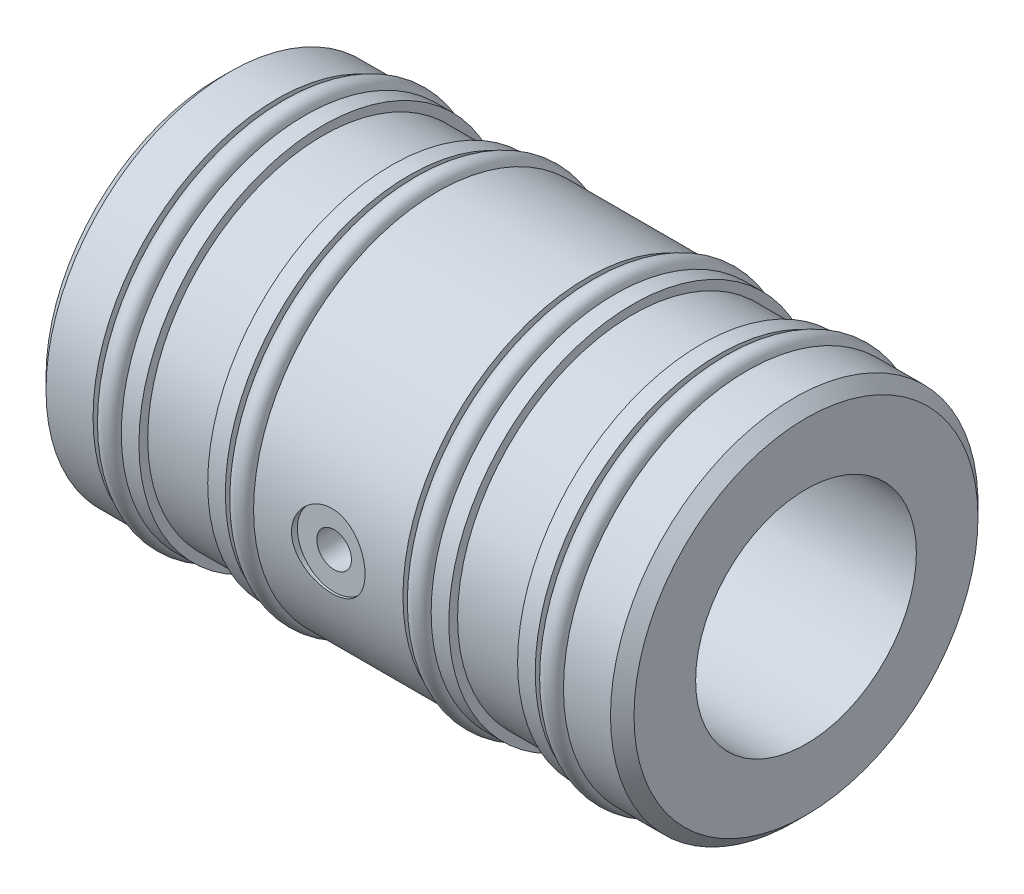
ISO-10303-21;
HEADER;
FILE_DESCRIPTION(('STEP AP214'),'2;1');
FILE_NAME('part.step','',(''),(''),'','','');
FILE_SCHEMA(('AUTOMOTIVE_DESIGN { 1 0 10303 214 1 1 1 1 }'));
ENDSEC;
DATA;
#1=APPLICATION_CONTEXT('core data for automotive mechanical design processes');
#2=APPLICATION_PROTOCOL_DEFINITION('international standard','automotive_design',2000,#1);
#3=PRODUCT_CONTEXT('',#1,'mechanical');
#4=PRODUCT('Part','Part','',(#3));
#5=PRODUCT_RELATED_PRODUCT_CATEGORY('part','',(#4));
#6=PRODUCT_DEFINITION_FORMATION('','',#4);
#7=PRODUCT_DEFINITION_CONTEXT('part definition',#1,'design');
#8=PRODUCT_DEFINITION('design','',#6,#7);
#9=PRODUCT_DEFINITION_SHAPE('','',#8);
#10=(LENGTH_UNIT() NAMED_UNIT(*) SI_UNIT(.MILLI.,.METRE.));
#11=(NAMED_UNIT(*) PLANE_ANGLE_UNIT() SI_UNIT($,.RADIAN.));
#12=(NAMED_UNIT(*) SI_UNIT($,.STERADIAN.) SOLID_ANGLE_UNIT());
#13=UNCERTAINTY_MEASURE_WITH_UNIT(LENGTH_MEASURE(1.E-05),#10,'distance_accuracy_value','');
#14=(GEOMETRIC_REPRESENTATION_CONTEXT(3) GLOBAL_UNCERTAINTY_ASSIGNED_CONTEXT((#13)) GLOBAL_UNIT_ASSIGNED_CONTEXT((#10,
#11,#12)) REPRESENTATION_CONTEXT('',''));
#15=CARTESIAN_POINT('',(0.,0.,0.));
#16=DIRECTION('',(0.,0.,1.));
#17=DIRECTION('',(1.,0.,0.));
#18=AXIS2_PLACEMENT_3D('',#15,#16,#17);
#19=CARTESIAN_POINT('',(0.,0.,0.));
#20=DIRECTION('',(-1.,0.,0.));
#21=DIRECTION('',(0.,0.,1.));
#22=AXIS2_PLACEMENT_3D('',#19,#20,#21);
#23=CYLINDRICAL_SURFACE('',#22,14.605);
#24=CARTESIAN_POINT('',(43.2816,0.,0.));
#25=DIRECTION('',(-1.,0.,0.));
#26=DIRECTION('',(0.,0.,1.));
#27=AXIS2_PLACEMENT_3D('',#24,#25,#26);
#28=CIRCLE('',#27,14.605);
#29=CARTESIAN_POINT('',(43.2816,0.,14.605));
#30=VERTEX_POINT('',#29);
#31=EDGE_CURVE('E307',#30,#30,#28,.T.);
#32=ORIENTED_EDGE('',*,*,#31,.F.);
#33=EDGE_LOOP('',(#32));
#34=FACE_BOUND('',#33,.T.);
#35=CARTESIAN_POINT('',(44.4341764245931,0.,0.));
#36=DIRECTION('',(1.,0.,0.));
#37=DIRECTION('',(0.,0.,-1.));
#38=AXIS2_PLACEMENT_3D('',#35,#36,#37);
#39=CIRCLE('',#38,14.605);
#40=CARTESIAN_POINT('',(44.4341764245931,0.,-14.605));
#41=VERTEX_POINT('',#40);
#42=EDGE_CURVE('E12',#41,#41,#39,.T.);
#43=ORIENTED_EDGE('',*,*,#42,.F.);
#44=EDGE_LOOP('',(#43));
#45=FACE_BOUND('',#44,.T.);
#46=ADVANCED_FACE('F36',(#34,#45),#23,.T.);
#47=CARTESIAN_POINT('',(45.72,0.,0.));
#48=DIRECTION('',(-1.,0.,0.));
#49=DIRECTION('',(0.,0.,1.));
#50=AXIS2_PLACEMENT_3D('',#47,#48,#49);
#51=CIRCLE('',#50,14.605);
#52=CARTESIAN_POINT('',(45.72,0.,14.605));
#53=VERTEX_POINT('',#52);
#54=EDGE_CURVE('E306',#53,#53,#51,.T.);
#55=ORIENTED_EDGE('',*,*,#54,.T.);
#56=EDGE_LOOP('',(#55));
#57=FACE_BOUND('',#56,.T.);
#58=CARTESIAN_POINT('',(44.5674235754069,0.,0.));
#59=DIRECTION('',(-1.,0.,0.));
#60=DIRECTION('',(0.,0.,1.));
#61=AXIS2_PLACEMENT_3D('',#58,#59,#60);
#62=CIRCLE('',#61,14.605);
#63=CARTESIAN_POINT('',(44.5674235754069,0.,14.605));
#64=VERTEX_POINT('',#63);
#65=EDGE_CURVE('E44',#64,#64,#62,.T.);
#66=ORIENTED_EDGE('',*,*,#65,.F.);
#67=EDGE_LOOP('',(#66));
#68=FACE_BOUND('',#67,.T.);
#69=ADVANCED_FACE('F104',(#57,#68),#23,.T.);
#70=CARTESIAN_POINT('',(0.,0.,0.));
#71=DIRECTION('',(-1.,0.,0.));
#72=DIRECTION('',(0.,0.,1.));
#73=AXIS2_PLACEMENT_3D('',#70,#71,#72);
#74=CYLINDRICAL_SURFACE('',#73,14.605);
#75=CARTESIAN_POINT('',(31.8516,0.,0.));
#76=DIRECTION('',(-1.,0.,0.));
#77=DIRECTION('',(0.,0.,1.));
#78=AXIS2_PLACEMENT_3D('',#75,#76,#77);
#79=CIRCLE('',#78,14.605);
#80=CARTESIAN_POINT('',(31.8516,0.,14.605));
#81=VERTEX_POINT('',#80);
#82=EDGE_CURVE('E150',#81,#81,#79,.T.);
#83=ORIENTED_EDGE('',*,*,#82,.F.);
#84=EDGE_LOOP('',(#83));
#85=FACE_BOUND('',#84,.T.);
#86=CARTESIAN_POINT('',(33.0041764245931,0.,0.));
#87=DIRECTION('',(1.,0.,0.));
#88=DIRECTION('',(0.,0.,-1.));
#89=AXIS2_PLACEMENT_3D('',#86,#87,#88);
#90=CIRCLE('',#89,14.605);
#91=CARTESIAN_POINT('',(33.0041764245931,0.,-14.605));
#92=VERTEX_POINT('',#91);
#93=EDGE_CURVE('E292',#92,#92,#90,.T.);
#94=ORIENTED_EDGE('',*,*,#93,.F.);
#95=EDGE_LOOP('',(#94));
#96=FACE_BOUND('',#95,.T.);
#97=ADVANCED_FACE('F134',(#85,#96),#74,.T.);
#98=CARTESIAN_POINT('',(34.29,0.,0.));
#99=DIRECTION('',(-1.,0.,0.));
#100=DIRECTION('',(0.,0.,1.));
#101=AXIS2_PLACEMENT_3D('',#98,#99,#100);
#102=CIRCLE('',#101,14.605);
#103=CARTESIAN_POINT('',(34.29,0.,14.605));
#104=VERTEX_POINT('',#103);
#105=EDGE_CURVE('E151',#104,#104,#102,.T.);
#106=ORIENTED_EDGE('',*,*,#105,.T.);
#107=EDGE_LOOP('',(#106));
#108=FACE_BOUND('',#107,.T.);
#109=CARTESIAN_POINT('',(33.1374235754069,0.,0.));
#110=DIRECTION('',(-1.,0.,0.));
#111=DIRECTION('',(0.,0.,1.));
#112=AXIS2_PLACEMENT_3D('',#109,#110,#111);
#113=CIRCLE('',#112,14.605);
#114=CARTESIAN_POINT('',(33.1374235754069,0.,14.605));
#115=VERTEX_POINT('',#114);
#116=EDGE_CURVE('E285',#115,#115,#113,.T.);
#117=ORIENTED_EDGE('',*,*,#116,.F.);
#118=EDGE_LOOP('',(#117));
#119=FACE_BOUND('',#118,.T.);
#120=ADVANCED_FACE('F136',(#108,#119),#74,.T.);
#121=CARTESIAN_POINT('',(0.,0.,0.));
#122=DIRECTION('',(-1.,0.,0.));
#123=DIRECTION('',(0.,0.,1.));
#124=AXIS2_PLACEMENT_3D('',#121,#122,#123);
#125=CYLINDRICAL_SURFACE('',#124,14.605);
#126=CARTESIAN_POINT('',(16.51,0.,0.));
#127=DIRECTION('',(-1.,0.,0.));
#128=DIRECTION('',(0.,0.,1.));
#129=AXIS2_PLACEMENT_3D('',#126,#127,#128);
#130=CIRCLE('',#129,14.605);
#131=CARTESIAN_POINT('',(16.51,0.,14.605));
#132=VERTEX_POINT('',#131);
#133=EDGE_CURVE('E165',#132,#132,#130,.T.);
#134=ORIENTED_EDGE('',*,*,#133,.F.);
#135=EDGE_LOOP('',(#134));
#136=FACE_BOUND('',#135,.T.);
#137=CARTESIAN_POINT('',(17.6625764245931,0.,0.));
#138=DIRECTION('',(1.,0.,0.));
#139=DIRECTION('',(0.,0.,-1.));
#140=AXIS2_PLACEMENT_3D('',#137,#138,#139);
#141=CIRCLE('',#140,14.605);
#142=CARTESIAN_POINT('',(17.6625764245931,0.,-14.605));
#143=VERTEX_POINT('',#142);
#144=EDGE_CURVE('E282',#143,#143,#141,.T.);
#145=ORIENTED_EDGE('',*,*,#144,.F.);
#146=EDGE_LOOP('',(#145));
#147=FACE_BOUND('',#146,.T.);
#148=ADVANCED_FACE('F264',(#136,#147),#125,.T.);
#149=CARTESIAN_POINT('',(18.9484,0.,0.));
#150=DIRECTION('',(-1.,0.,0.));
#151=DIRECTION('',(0.,0.,1.));
#152=AXIS2_PLACEMENT_3D('',#149,#150,#151);
#153=CIRCLE('',#152,14.605);
#154=CARTESIAN_POINT('',(18.9484,0.,14.605));
#155=VERTEX_POINT('',#154);
#156=EDGE_CURVE('E162',#155,#155,#153,.T.);
#157=ORIENTED_EDGE('',*,*,#156,.T.);
#158=EDGE_LOOP('',(#157));
#159=FACE_BOUND('',#158,.T.);
#160=CARTESIAN_POINT('',(17.7958235754069,0.,0.));
#161=DIRECTION('',(-1.,0.,0.));
#162=DIRECTION('',(0.,0.,1.));
#163=AXIS2_PLACEMENT_3D('',#160,#161,#162);
#164=CIRCLE('',#163,14.605);
#165=CARTESIAN_POINT('',(17.7958235754069,0.,14.605));
#166=VERTEX_POINT('',#165);
#167=EDGE_CURVE('E280',#166,#166,#164,.T.);
#168=ORIENTED_EDGE('',*,*,#167,.F.);
#169=EDGE_LOOP('',(#168));
#170=FACE_BOUND('',#169,.T.);
#171=ADVANCED_FACE('F235',(#159,#170),#125,.T.);
#172=CARTESIAN_POINT('',(0.,0.,0.));
#173=DIRECTION('',(-1.,0.,0.));
#174=DIRECTION('',(0.,0.,1.));
#175=AXIS2_PLACEMENT_3D('',#172,#173,#174);
#176=CYLINDRICAL_SURFACE('',#175,14.605);
#177=CARTESIAN_POINT('',(5.08,0.,0.));
#178=DIRECTION('',(-1.,0.,0.));
#179=DIRECTION('',(0.,0.,1.));
#180=AXIS2_PLACEMENT_3D('',#177,#178,#179);
#181=CIRCLE('',#180,14.605);
#182=CARTESIAN_POINT('',(5.08,0.,14.605));
#183=VERTEX_POINT('',#182);
#184=EDGE_CURVE('E189',#183,#183,#181,.T.);
#185=ORIENTED_EDGE('',*,*,#184,.F.);
#186=EDGE_LOOP('',(#185));
#187=FACE_BOUND('',#186,.T.);
#188=CARTESIAN_POINT('',(6.23257642459312,0.,0.));
#189=DIRECTION('',(1.,0.,0.));
#190=DIRECTION('',(0.,0.,-1.));
#191=AXIS2_PLACEMENT_3D('',#188,#189,#190);
#192=CIRCLE('',#191,14.605);
#193=CARTESIAN_POINT('',(6.23257642459312,0.,-14.605));
#194=VERTEX_POINT('',#193);
#195=EDGE_CURVE('E61',#194,#194,#192,.T.);
#196=ORIENTED_EDGE('',*,*,#195,.F.);
#197=EDGE_LOOP('',(#196));
#198=FACE_BOUND('',#197,.T.);
#199=ADVANCED_FACE('F232',(#187,#198),#176,.T.);
#200=CARTESIAN_POINT('',(7.5184,0.,0.));
#201=DIRECTION('',(-1.,0.,0.));
#202=DIRECTION('',(0.,0.,1.));
#203=AXIS2_PLACEMENT_3D('',#200,#201,#202);
#204=CIRCLE('',#203,14.605);
#205=CARTESIAN_POINT('',(7.5184,0.,14.605));
#206=VERTEX_POINT('',#205);
#207=EDGE_CURVE('E186',#206,#206,#204,.T.);
#208=ORIENTED_EDGE('',*,*,#207,.T.);
#209=EDGE_LOOP('',(#208));
#210=FACE_BOUND('',#209,.T.);
#211=CARTESIAN_POINT('',(6.36582357540688,0.,0.));
#212=DIRECTION('',(-1.,0.,0.));
#213=DIRECTION('',(0.,0.,1.));
#214=AXIS2_PLACEMENT_3D('',#211,#212,#213);
#215=CIRCLE('',#214,14.605);
#216=CARTESIAN_POINT('',(6.36582357540688,0.,14.605));
#217=VERTEX_POINT('',#216);
#218=EDGE_CURVE('E59',#217,#217,#215,.T.);
#219=ORIENTED_EDGE('',*,*,#218,.F.);
#220=EDGE_LOOP('',(#219));
#221=FACE_BOUND('',#220,.T.);
#222=ADVANCED_FACE('F222',(#210,#221),#176,.T.);
#223=CARTESIAN_POINT('',(0.,9.53516,0.));
#224=DIRECTION('',(1.,0.,0.));
#225=DIRECTION('',(0.,0.,-1.));
#226=AXIS2_PLACEMENT_3D('',#223,#224,#225);
#227=PLANE('',#226);
#228=CARTESIAN_POINT('',(0.,0.,0.));
#229=DIRECTION('',(1.,0.,0.));
#230=DIRECTION('',(0.,0.,-1.));
#231=AXIS2_PLACEMENT_3D('',#228,#229,#230);
#232=CIRCLE('',#231,14.859);
#233=CARTESIAN_POINT('',(0.,0.,-14.859));
#234=VERTEX_POINT('',#233);
#235=EDGE_CURVE('E195',#234,#234,#232,.F.);
#236=ORIENTED_EDGE('',*,*,#235,.T.);
#237=EDGE_LOOP('',(#236));
#238=FACE_BOUND('',#237,.T.);
#239=CARTESIAN_POINT('',(0.,0.,0.));
#240=DIRECTION('',(-1.,0.,0.));
#241=DIRECTION('',(0.,0.,1.));
#242=AXIS2_PLACEMENT_3D('',#239,#240,#241);
#243=CIRCLE('',#242,9.53516);
#244=CARTESIAN_POINT('',(0.,0.,9.53516));
#245=VERTEX_POINT('',#244);
#246=EDGE_CURVE('E379',#245,#245,#243,.T.);
#247=ORIENTED_EDGE('',*,*,#246,.F.);
#248=EDGE_LOOP('',(#247));
#249=FACE_BOUND('',#248,.T.);
#250=ADVANCED_FACE('F218',(#238,#249),#227,.F.);
#251=CARTESIAN_POINT('',(0.,0.,0.));
#252=DIRECTION('',(-1.,0.,0.));
#253=DIRECTION('',(0.,0.,1.));
#254=AXIS2_PLACEMENT_3D('',#251,#252,#253);
#255=CYLINDRICAL_SURFACE('',#254,15.875);
#256=CARTESIAN_POINT('',(1.01600000000001,0.,0.));
#257=DIRECTION('',(1.,0.,0.));
#258=DIRECTION('',(0.,0.,-1.));
#259=AXIS2_PLACEMENT_3D('',#256,#257,#258);
#260=CIRCLE('',#259,15.875);
#261=CARTESIAN_POINT('',(1.01600000000001,0.,-15.875));
#262=VERTEX_POINT('',#261);
#263=EDGE_CURVE('E198',#262,#262,#260,.T.);
#264=ORIENTED_EDGE('',*,*,#263,.T.);
#265=EDGE_LOOP('',(#264));
#266=FACE_BOUND('',#265,.T.);
#267=CARTESIAN_POINT('',(5.08,0.,0.));
#268=DIRECTION('',(-1.,0.,0.));
#269=DIRECTION('',(0.,0.,1.));
#270=AXIS2_PLACEMENT_3D('',#267,#268,#269);
#271=CIRCLE('',#270,15.875);
#272=CARTESIAN_POINT('',(5.08,0.,15.875));
#273=VERTEX_POINT('',#272);
#274=EDGE_CURVE('E192',#273,#273,#271,.T.);
#275=ORIENTED_EDGE('',*,*,#274,.T.);
#276=EDGE_LOOP('',(#275));
#277=FACE_BOUND('',#276,.T.);
#278=ADVANCED_FACE('F221',(#266,#277),#255,.T.);
#279=CARTESIAN_POINT('',(5.08,15.875,0.));
#280=DIRECTION('',(-1.,0.,0.));
#281=DIRECTION('',(0.,0.,1.));
#282=AXIS2_PLACEMENT_3D('',#279,#280,#281);
#283=PLANE('',#282);
#284=ORIENTED_EDGE('',*,*,#274,.F.);
#285=EDGE_LOOP('',(#284));
#286=FACE_BOUND('',#285,.T.);
#287=ORIENTED_EDGE('',*,*,#184,.T.);
#288=EDGE_LOOP('',(#287));
#289=FACE_BOUND('',#288,.T.);
#290=ADVANCED_FACE('F226',(#286,#289),#283,.F.);
#291=CARTESIAN_POINT('',(7.5184,14.605,0.));
#292=DIRECTION('',(1.,0.,0.));
#293=DIRECTION('',(0.,0.,-1.));
#294=AXIS2_PLACEMENT_3D('',#291,#292,#293);
#295=PLANE('',#294);
#296=ORIENTED_EDGE('',*,*,#207,.F.);
#297=EDGE_LOOP('',(#296));
#298=FACE_BOUND('',#297,.T.);
#299=CARTESIAN_POINT('',(7.5184,0.,0.));
#300=DIRECTION('',(-1.,0.,0.));
#301=DIRECTION('',(0.,0.,1.));
#302=AXIS2_PLACEMENT_3D('',#299,#300,#301);
#303=CIRCLE('',#302,15.875);
#304=CARTESIAN_POINT('',(7.5184,0.,15.875));
#305=VERTEX_POINT('',#304);
#306=EDGE_CURVE('E183',#305,#305,#303,.T.);
#307=ORIENTED_EDGE('',*,*,#306,.T.);
#308=EDGE_LOOP('',(#307));
#309=FACE_BOUND('',#308,.T.);
#310=ADVANCED_FACE('F230',(#298,#309),#295,.F.);
#311=CARTESIAN_POINT('',(0.,0.,0.));
#312=DIRECTION('',(-1.,0.,0.));
#313=DIRECTION('',(0.,0.,1.));
#314=AXIS2_PLACEMENT_3D('',#311,#312,#313);
#315=CYLINDRICAL_SURFACE('',#314,15.875);
#316=ORIENTED_EDGE('',*,*,#306,.F.);
#317=EDGE_LOOP('',(#316));
#318=FACE_BOUND('',#317,.T.);
#319=CARTESIAN_POINT('',(9.0424,0.,0.));
#320=DIRECTION('',(-1.,0.,0.));
#321=DIRECTION('',(0.,0.,1.));
#322=AXIS2_PLACEMENT_3D('',#319,#320,#321);
#323=CIRCLE('',#322,15.875);
#324=CARTESIAN_POINT('',(9.0424,0.,15.875));
#325=VERTEX_POINT('',#324);
#326=EDGE_CURVE('E180',#325,#325,#323,.T.);
#327=ORIENTED_EDGE('',*,*,#326,.T.);
#328=EDGE_LOOP('',(#327));
#329=FACE_BOUND('',#328,.T.);
#330=ADVANCED_FACE('F239',(#318,#329),#315,.T.);
#331=CARTESIAN_POINT('',(9.0424,15.875,0.));
#332=DIRECTION('',(-1.,0.,0.));
#333=DIRECTION('',(0.,0.,1.));
#334=AXIS2_PLACEMENT_3D('',#331,#332,#333);
#335=PLANE('',#334);
#336=ORIENTED_EDGE('',*,*,#326,.F.);
#337=EDGE_LOOP('',(#336));
#338=FACE_BOUND('',#337,.T.);
#339=CARTESIAN_POINT('',(9.0424,0.,0.));
#340=DIRECTION('',(-1.,0.,0.));
#341=DIRECTION('',(0.,0.,1.));
#342=AXIS2_PLACEMENT_3D('',#339,#340,#341);
#343=CIRCLE('',#342,15.113);
#344=CARTESIAN_POINT('',(9.0424,0.,15.113));
#345=VERTEX_POINT('',#344);
#346=EDGE_CURVE('E177',#345,#345,#343,.T.);
#347=ORIENTED_EDGE('',*,*,#346,.T.);
#348=EDGE_LOOP('',(#347));
#349=FACE_BOUND('',#348,.T.);
#350=ADVANCED_FACE('F243',(#338,#349),#335,.F.);
#351=CARTESIAN_POINT('',(0.,0.,0.));
#352=DIRECTION('',(-1.,0.,0.));
#353=DIRECTION('',(0.,0.,1.));
#354=AXIS2_PLACEMENT_3D('',#351,#352,#353);
#355=CYLINDRICAL_SURFACE('',#354,15.113);
#356=ORIENTED_EDGE('',*,*,#346,.F.);
#357=EDGE_LOOP('',(#356));
#358=FACE_BOUND('',#357,.T.);
#359=CARTESIAN_POINT('',(14.986,0.,0.));
#360=DIRECTION('',(-1.,0.,0.));
#361=DIRECTION('',(0.,0.,1.));
#362=AXIS2_PLACEMENT_3D('',#359,#360,#361);
#363=CIRCLE('',#362,15.113);
#364=CARTESIAN_POINT('',(14.986,0.,15.113));
#365=VERTEX_POINT('',#364);
#366=EDGE_CURVE('E174',#365,#365,#363,.T.);
#367=ORIENTED_EDGE('',*,*,#366,.T.);
#368=EDGE_LOOP('',(#367));
#369=FACE_BOUND('',#368,.T.);
#370=ADVANCED_FACE('F247',(#358,#369),#355,.T.);
#371=CARTESIAN_POINT('',(14.986,15.113,0.));
#372=DIRECTION('',(1.,0.,0.));
#373=DIRECTION('',(0.,0.,-1.));
#374=AXIS2_PLACEMENT_3D('',#371,#372,#373);
#375=PLANE('',#374);
#376=ORIENTED_EDGE('',*,*,#366,.F.);
#377=EDGE_LOOP('',(#376));
#378=FACE_BOUND('',#377,.T.);
#379=CARTESIAN_POINT('',(14.986,0.,0.));
#380=DIRECTION('',(-1.,0.,0.));
#381=DIRECTION('',(0.,0.,1.));
#382=AXIS2_PLACEMENT_3D('',#379,#380,#381);
#383=CIRCLE('',#382,15.875);
#384=CARTESIAN_POINT('',(14.986,0.,15.875));
#385=VERTEX_POINT('',#384);
#386=EDGE_CURVE('E171',#385,#385,#383,.T.);
#387=ORIENTED_EDGE('',*,*,#386,.T.);
#388=EDGE_LOOP('',(#387));
#389=FACE_BOUND('',#388,.T.);
#390=ADVANCED_FACE('F251',(#378,#389),#375,.F.);
#391=CARTESIAN_POINT('',(0.,0.,0.));
#392=DIRECTION('',(-1.,0.,0.));
#393=DIRECTION('',(0.,0.,1.));
#394=AXIS2_PLACEMENT_3D('',#391,#392,#393);
#395=CYLINDRICAL_SURFACE('',#394,15.875);
#396=ORIENTED_EDGE('',*,*,#386,.F.);
#397=EDGE_LOOP('',(#396));
#398=FACE_BOUND('',#397,.T.);
#399=CARTESIAN_POINT('',(16.51,0.,0.));
#400=DIRECTION('',(-1.,0.,0.));
#401=DIRECTION('',(0.,0.,1.));
#402=AXIS2_PLACEMENT_3D('',#399,#400,#401);
#403=CIRCLE('',#402,15.875);
#404=CARTESIAN_POINT('',(16.51,0.,15.875));
#405=VERTEX_POINT('',#404);
#406=EDGE_CURVE('E168',#405,#405,#403,.T.);
#407=ORIENTED_EDGE('',*,*,#406,.T.);
#408=EDGE_LOOP('',(#407));
#409=FACE_BOUND('',#408,.T.);
#410=ADVANCED_FACE('F255',(#398,#409),#395,.T.);
#411=CARTESIAN_POINT('',(16.51,15.875,0.));
#412=DIRECTION('',(-1.,0.,0.));
#413=DIRECTION('',(0.,0.,1.));
#414=AXIS2_PLACEMENT_3D('',#411,#412,#413);
#415=PLANE('',#414);
#416=ORIENTED_EDGE('',*,*,#406,.F.);
#417=EDGE_LOOP('',(#416));
#418=FACE_BOUND('',#417,.T.);
#419=ORIENTED_EDGE('',*,*,#133,.T.);
#420=EDGE_LOOP('',(#419));
#421=FACE_BOUND('',#420,.T.);
#422=ADVANCED_FACE('F259',(#418,#421),#415,.F.);
#423=CARTESIAN_POINT('',(18.9484,14.605,0.));
#424=DIRECTION('',(1.,0.,0.));
#425=DIRECTION('',(0.,0.,-1.));
#426=AXIS2_PLACEMENT_3D('',#423,#424,#425);
#427=PLANE('',#426);
#428=ORIENTED_EDGE('',*,*,#156,.F.);
#429=EDGE_LOOP('',(#428));
#430=FACE_BOUND('',#429,.T.);
#431=CARTESIAN_POINT('',(18.9484,0.,0.));
#432=DIRECTION('',(-1.,0.,0.));
#433=DIRECTION('',(0.,0.,1.));
#434=AXIS2_PLACEMENT_3D('',#431,#432,#433);
#435=CIRCLE('',#434,15.875);
#436=CARTESIAN_POINT('',(18.9484,0.,15.875));
#437=VERTEX_POINT('',#436);
#438=EDGE_CURVE('E153',#437,#437,#435,.T.);
#439=ORIENTED_EDGE('',*,*,#438,.T.);
#440=EDGE_LOOP('',(#439));
#441=FACE_BOUND('',#440,.T.);
#442=ADVANCED_FACE('F143',(#430,#441),#427,.F.);
#443=CARTESIAN_POINT('',(0.,0.,0.));
#444=DIRECTION('',(-1.,0.,0.));
#445=DIRECTION('',(0.,0.,1.));
#446=AXIS2_PLACEMENT_3D('',#443,#444,#445);
#447=CYLINDRICAL_SURFACE('',#446,15.875);
#448=CARTESIAN_POINT('',(28.575,0.,15.875));
#449=CARTESIAN_POINT('',(28.5749935087178,-0.17645667906661,15.8749967481927));
#450=CARTESIAN_POINT('',(28.5602399235777,-0.352995421139834,15.8720277294088));
#451=CARTESIAN_POINT('',(28.5016622621341,-0.701082886912636,15.8604701085376));
#452=CARTESIAN_POINT('',(28.4578150908552,-0.872627533193804,15.8518770420609));
#453=CARTESIAN_POINT('',(28.342458956254,-1.20564371921102,15.8300308645856));
#454=CARTESIAN_POINT('',(28.2709764880181,-1.3671247356877,15.8167822181858));
#455=CARTESIAN_POINT('',(28.1024576141516,-1.67579036464392,15.7870651376212));
#456=CARTESIAN_POINT('',(28.0054227304471,-1.8229758278657,15.7705968952337));
#457=CARTESIAN_POINT('',(27.7871602806247,-2.1008767904747,15.7360037492265));
#458=CARTESIAN_POINT('',(27.6656534716329,-2.23137079492832,15.717861169763));
#459=CARTESIAN_POINT('',(27.4024965779563,-2.47026670223049,15.6820927293697));
#460=CARTESIAN_POINT('',(27.260844921511,-2.5786668796461,15.6644669088885));
#461=CARTESIAN_POINT('',(26.9598260871873,-2.77124081687869,15.6315550275505));
#462=CARTESIAN_POINT('',(26.8003094809466,-2.85518523089913,15.616291708837));
#463=CARTESIAN_POINT('',(26.469080224662,-2.99499549139248,15.5900840108548));
#464=CARTESIAN_POINT('',(26.2973687813754,-3.05086411173823,15.5791392049423));
#465=CARTESIAN_POINT('',(25.9490071445924,-3.13221782713433,15.5629865667575));
#466=CARTESIAN_POINT('',(25.7724511723484,-3.15809153101912,15.5577054259032));
#467=CARTESIAN_POINT('',(25.4174313171682,-3.17992800553043,15.5532574081749));
#468=CARTESIAN_POINT('',(25.2389676311835,-3.17589383461536,15.5540899061039));
#469=CARTESIAN_POINT('',(24.8880414480333,-3.13834326959827,15.5617084989549));
#470=CARTESIAN_POINT('',(24.7155290371333,-3.1052723652744,15.5684046282657));
#471=CARTESIAN_POINT('',(24.378551456595,-3.01129028367818,15.58685434058));
#472=CARTESIAN_POINT('',(24.2140866716821,-2.95037777684466,15.5986081651095));
#473=CARTESIAN_POINT('',(23.8965890440911,-2.80201618816723,15.625940887388));
#474=CARTESIAN_POINT('',(23.7436409823679,-2.71439053016196,15.6415451015851));
#475=CARTESIAN_POINT('',(23.4544525513363,-2.51521459926825,15.6748041460447));
#476=CARTESIAN_POINT('',(23.3182141049976,-2.40366157683293,15.6924592118681));
#477=CARTESIAN_POINT('',(23.0637416471992,-2.15741229222985,15.7282204244164));
#478=CARTESIAN_POINT('',(22.9458755970473,-2.02233581184951,15.7463289724462));
#479=CARTESIAN_POINT('',(22.7344165379936,-1.73413745139688,15.7806659466825));
#480=CARTESIAN_POINT('',(22.6408238403929,-1.58101533992956,15.7968943487749));
#481=CARTESIAN_POINT('',(22.4805001582075,-1.26066355334057,15.8256824126082));
#482=CARTESIAN_POINT('',(22.4138112376786,-1.09341227718333,15.8382363209326));
#483=CARTESIAN_POINT('',(22.3095804949275,-0.74977300022451,15.8582172353645));
#484=CARTESIAN_POINT('',(22.2720351419162,-0.573386108980027,15.8656448625169));
#485=CARTESIAN_POINT('',(22.2276782592032,-0.219644612866203,15.8744498317731));
#486=CARTESIAN_POINT('',(22.2203631679596,-0.0423555424337052,15.8759262952159));
#487=CARTESIAN_POINT('',(22.2353183021414,0.310911666061866,15.8729378987808));
#488=CARTESIAN_POINT('',(22.2575868644445,0.486889877259043,15.8684733728909));
#489=CARTESIAN_POINT('',(22.3306588360021,0.830915470330267,15.8541666662546));
#490=CARTESIAN_POINT('',(22.3812038674808,0.999019935979192,15.8443732008336));
#491=CARTESIAN_POINT('',(22.5091116449322,1.32436751731144,15.8205027779378));
#492=CARTESIAN_POINT('',(22.5864764000989,1.48160981819919,15.8064254995517));
#493=CARTESIAN_POINT('',(22.7669169078179,1.78289322645374,15.7753021911821));
#494=CARTESIAN_POINT('',(22.8702958297986,1.9267491524382,15.7582219263764));
#495=CARTESIAN_POINT('',(23.0994241820831,2.19525221070348,15.7230678308488));
#496=CARTESIAN_POINT('',(23.2251760108196,2.31989728085517,15.7049938937463));
#497=CARTESIAN_POINT('',(23.4977728922543,2.54838387570801,15.6695553879336));
#498=CARTESIAN_POINT('',(23.6449099879027,2.65187970527448,15.6522058124074));
#499=CARTESIAN_POINT('',(23.9547760723075,2.83268870866258,15.6204980895292));
#500=CARTESIAN_POINT('',(24.117504436896,2.91000293005522,15.6061398224986));
#501=CARTESIAN_POINT('',(24.4531141815248,3.03578209702272,15.5821615135542));
#502=CARTESIAN_POINT('',(24.6259376708428,3.08439661183659,15.5725169521919));
#503=CARTESIAN_POINT('',(24.9775137148336,3.15184996891635,15.5590061181468));
#504=CARTESIAN_POINT('',(25.1562654932147,3.17069269411473,15.5551390919428));
#505=CARTESIAN_POINT('',(25.5111531449282,3.17792389200421,15.5536630007963));
#506=CARTESIAN_POINT('',(25.6872776478433,3.1668586271251,15.5559416842603));
#507=CARTESIAN_POINT('',(26.0351004884485,3.11579356551769,15.5662494581365));
#508=CARTESIAN_POINT('',(26.206798861681,3.07579400121052,15.5742785023576));
#509=CARTESIAN_POINT('',(26.5405479831887,2.96823945498418,15.5951321389583));
#510=CARTESIAN_POINT('',(26.7026210945952,2.90075145882757,15.6079450673479));
#511=CARTESIAN_POINT('',(27.0132293133319,2.74019849661009,15.6369294504299));
#512=CARTESIAN_POINT('',(27.1617632840773,2.64713138586025,15.6531011867149));
#513=CARTESIAN_POINT('',(27.4437969415772,2.43619627944687,15.6873244966124));
#514=CARTESIAN_POINT('',(27.5769983297246,2.3179337919717,15.705403339883));
#515=CARTESIAN_POINT('',(27.8218462025551,2.06077937161672,15.7412080994346));
#516=CARTESIAN_POINT('',(27.9334877267573,1.92188270421184,15.7589339336561));
#517=CARTESIAN_POINT('',(28.13314999453,1.62565597235519,15.7922541783181));
#518=CARTESIAN_POINT('',(28.2209113104141,1.46814820806473,15.8078243412111));
#519=CARTESIAN_POINT('',(28.3685809392442,1.14035319598683,15.8348402214487));
#520=CARTESIAN_POINT('',(28.4285143567657,0.970077628240428,15.8462896541511));
#521=CARTESIAN_POINT('',(28.507219935042,0.666183227333001,15.861549829903));
#522=CARTESIAN_POINT('',(28.5325921400221,0.534294283243766,15.8665641252808));
#523=CARTESIAN_POINT('',(28.5664843717378,0.268285992541962,15.8732903939416));
#524=CARTESIAN_POINT('',(28.5750049355685,0.134166717151865,15.8750024724727));
#525=CARTESIAN_POINT('',(28.575,0.,15.875));
#526=B_SPLINE_CURVE_WITH_KNOTS('',3,(#448,#449,#450,#451,#452,#453,#454,#455,#456,#457,#458,
#459,#460,#461,#462,#463,#464,#465,#466,#467,#468,#469,#470,#471,#472,#473,#474,#475,#476,#477,
#478,#479,#480,#481,#482,#483,#484,#485,#486,#487,#488,#489,#490,#491,#492,#493,#494,#495,#496,
#497,#498,#499,#500,#501,#502,#503,#504,#505,#506,#507,#508,#509,#510,#511,#512,#513,#514,#515,
#516,#517,#518,#519,#520,#521,#522,#523,#524,#525),.UNSPECIFIED.,.T.,.F.,(4,2,2,2,2,2,2,2,2,2,2,
2,2,2,2,2,2,2,2,2,2,2,2,2,2,2,2,2,2,2,2,2,2,2,2,2,2,2,4),(0.,0.528879214849496,1.05817876594495,
1.58697210941983,2.11573396458299,2.65091122760619,3.18613026967289,3.72621794143804,
4.26625224234502,4.7992088770389,5.3321110109289,5.85697733244934,6.38186872130592,
6.91030781396407,7.43880766330204,7.97681451660039,8.5148282693893,9.05367997661526,
9.59246639091264,10.1222408577214,10.6519855431373,11.1769669129355,11.7019876201087,
12.2334358465591,12.7649410799833,13.3045399573904,13.8441172419701,14.380857097789,
14.9175269444907,15.4444611915245,15.9713912058903,16.4970447697862,17.0227424207243,
17.5573714205928,18.0921232814205,18.6324715194515,19.1723313376812,19.5744711154541,
19.9765980760291),.UNSPECIFIED.);
#527=CARTESIAN_POINT('',(22.225,0.,15.875));
#528=VERTEX_POINT('',#527);
#529=CARTESIAN_POINT('',(28.575,0.,15.875));
#530=VERTEX_POINT('',#529);
#531=EDGE_CURVE('E52',#528,#530,#526,.T.);
#532=ORIENTED_EDGE('',*,*,#531,.T.);
#533=EDGE_CURVE('E50',#530,#528,#526,.T.);
#534=ORIENTED_EDGE('',*,*,#533,.T.);
#535=EDGE_LOOP('',(#532,#534));
#536=FACE_BOUND('',#535,.T.);
#537=ORIENTED_EDGE('',*,*,#438,.F.);
#538=EDGE_LOOP('',(#537));
#539=FACE_BOUND('',#538,.T.);
#540=CARTESIAN_POINT('',(31.8516,0.,0.));
#541=DIRECTION('',(-1.,0.,0.));
#542=DIRECTION('',(0.,0.,1.));
#543=AXIS2_PLACEMENT_3D('',#540,#541,#542);
#544=CIRCLE('',#543,15.875);
#545=CARTESIAN_POINT('',(31.8516,0.,15.875));
#546=VERTEX_POINT('',#545);
#547=EDGE_CURVE('E147',#546,#546,#544,.T.);
#548=ORIENTED_EDGE('',*,*,#547,.T.);
#549=EDGE_LOOP('',(#548));
#550=FACE_BOUND('',#549,.T.);
#551=ADVANCED_FACE('F57',(#536,#539,#550),#447,.T.);
#552=CARTESIAN_POINT('',(31.8516,15.875,0.));
#553=DIRECTION('',(-1.,0.,0.));
#554=DIRECTION('',(0.,0.,1.));
#555=AXIS2_PLACEMENT_3D('',#552,#553,#554);
#556=PLANE('',#555);
#557=ORIENTED_EDGE('',*,*,#547,.F.);
#558=EDGE_LOOP('',(#557));
#559=FACE_BOUND('',#558,.T.);
#560=ORIENTED_EDGE('',*,*,#82,.T.);
#561=EDGE_LOOP('',(#560));
#562=FACE_BOUND('',#561,.T.);
#563=ADVANCED_FACE('F132',(#559,#562),#556,.F.);
#564=CARTESIAN_POINT('',(34.29,15.875,0.));
#565=DIRECTION('',(1.,0.,0.));
#566=DIRECTION('',(0.,0.,-1.));
#567=AXIS2_PLACEMENT_3D('',#564,#565,#566);
#568=PLANE('',#567);
#569=ORIENTED_EDGE('',*,*,#105,.F.);
#570=EDGE_LOOP('',(#569));
#571=FACE_BOUND('',#570,.T.);
#572=CARTESIAN_POINT('',(34.29,0.,0.));
#573=DIRECTION('',(-1.,0.,0.));
#574=DIRECTION('',(0.,0.,1.));
#575=AXIS2_PLACEMENT_3D('',#572,#573,#574);
#576=CIRCLE('',#575,15.875);
#577=CARTESIAN_POINT('',(34.29,0.,15.875));
#578=VERTEX_POINT('',#577);
#579=EDGE_CURVE('E156',#578,#578,#576,.T.);
#580=ORIENTED_EDGE('',*,*,#579,.T.);
#581=EDGE_LOOP('',(#580));
#582=FACE_BOUND('',#581,.T.);
#583=ADVANCED_FACE('F128',(#571,#582),#568,.F.);
#584=CARTESIAN_POINT('',(0.,0.,0.));
#585=DIRECTION('',(-1.,0.,0.));
#586=DIRECTION('',(0.,0.,1.));
#587=AXIS2_PLACEMENT_3D('',#584,#585,#586);
#588=CYLINDRICAL_SURFACE('',#587,15.875);
#589=ORIENTED_EDGE('',*,*,#579,.F.);
#590=EDGE_LOOP('',(#589));
#591=FACE_BOUND('',#590,.T.);
#592=CARTESIAN_POINT('',(35.814,0.,0.));
#593=DIRECTION('',(-1.,0.,0.));
#594=DIRECTION('',(0.,0.,1.));
#595=AXIS2_PLACEMENT_3D('',#592,#593,#594);
#596=CIRCLE('',#595,15.875);
#597=CARTESIAN_POINT('',(35.814,0.,15.875));
#598=VERTEX_POINT('',#597);
#599=EDGE_CURVE('E329',#598,#598,#596,.T.);
#600=ORIENTED_EDGE('',*,*,#599,.T.);
#601=EDGE_LOOP('',(#600));
#602=FACE_BOUND('',#601,.T.);
#603=ADVANCED_FACE('F124',(#591,#602),#588,.T.);
#604=CARTESIAN_POINT('',(35.814,15.113,0.));
#605=DIRECTION('',(-1.,0.,0.));
#606=DIRECTION('',(0.,0.,1.));
#607=AXIS2_PLACEMENT_3D('',#604,#605,#606);
#608=PLANE('',#607);
#609=ORIENTED_EDGE('',*,*,#599,.F.);
#610=EDGE_LOOP('',(#609));
#611=FACE_BOUND('',#610,.T.);
#612=CARTESIAN_POINT('',(35.814,0.,0.));
#613=DIRECTION('',(-1.,0.,0.));
#614=DIRECTION('',(0.,0.,1.));
#615=AXIS2_PLACEMENT_3D('',#612,#613,#614);
#616=CIRCLE('',#615,15.113);
#617=CARTESIAN_POINT('',(35.814,0.,15.113));
#618=VERTEX_POINT('',#617);
#619=EDGE_CURVE('E326',#618,#618,#616,.T.);
#620=ORIENTED_EDGE('',*,*,#619,.T.);
#621=EDGE_LOOP('',(#620));
#622=FACE_BOUND('',#621,.T.);
#623=ADVANCED_FACE('F120',(#611,#622),#608,.F.);
#624=CARTESIAN_POINT('',(0.,0.,0.));
#625=DIRECTION('',(-1.,0.,0.));
#626=DIRECTION('',(0.,0.,1.));
#627=AXIS2_PLACEMENT_3D('',#624,#625,#626);
#628=CYLINDRICAL_SURFACE('',#627,15.113);
#629=ORIENTED_EDGE('',*,*,#619,.F.);
#630=EDGE_LOOP('',(#629));
#631=FACE_BOUND('',#630,.T.);
#632=CARTESIAN_POINT('',(41.7576,0.,0.));
#633=DIRECTION('',(-1.,0.,0.));
#634=DIRECTION('',(0.,0.,1.));
#635=AXIS2_PLACEMENT_3D('',#632,#633,#634);
#636=CIRCLE('',#635,15.113);
#637=CARTESIAN_POINT('',(41.7576,0.,15.113));
#638=VERTEX_POINT('',#637);
#639=EDGE_CURVE('E323',#638,#638,#636,.T.);
#640=ORIENTED_EDGE('',*,*,#639,.T.);
#641=EDGE_LOOP('',(#640));
#642=FACE_BOUND('',#641,.T.);
#643=ADVANCED_FACE('F116',(#631,#642),#628,.T.);
#644=CARTESIAN_POINT('',(41.7576,15.875,0.));
#645=DIRECTION('',(1.,0.,0.));
#646=DIRECTION('',(0.,0.,-1.));
#647=AXIS2_PLACEMENT_3D('',#644,#645,#646);
#648=PLANE('',#647);
#649=ORIENTED_EDGE('',*,*,#639,.F.);
#650=EDGE_LOOP('',(#649));
#651=FACE_BOUND('',#650,.T.);
#652=CARTESIAN_POINT('',(41.7576,0.,0.));
#653=DIRECTION('',(-1.,0.,0.));
#654=DIRECTION('',(0.,0.,1.));
#655=AXIS2_PLACEMENT_3D('',#652,#653,#654);
#656=CIRCLE('',#655,15.875);
#657=CARTESIAN_POINT('',(41.7576,0.,15.875));
#658=VERTEX_POINT('',#657);
#659=EDGE_CURVE('E320',#658,#658,#656,.T.);
#660=ORIENTED_EDGE('',*,*,#659,.T.);
#661=EDGE_LOOP('',(#660));
#662=FACE_BOUND('',#661,.T.);
#663=ADVANCED_FACE('F112',(#651,#662),#648,.F.);
#664=CARTESIAN_POINT('',(0.,0.,0.));
#665=DIRECTION('',(-1.,0.,0.));
#666=DIRECTION('',(0.,0.,1.));
#667=AXIS2_PLACEMENT_3D('',#664,#665,#666);
#668=CYLINDRICAL_SURFACE('',#667,15.875);
#669=ORIENTED_EDGE('',*,*,#659,.F.);
#670=EDGE_LOOP('',(#669));
#671=FACE_BOUND('',#670,.T.);
#672=CARTESIAN_POINT('',(43.2816,0.,0.));
#673=DIRECTION('',(-1.,0.,0.));
#674=DIRECTION('',(0.,0.,1.));
#675=AXIS2_PLACEMENT_3D('',#672,#673,#674);
#676=CIRCLE('',#675,15.875);
#677=CARTESIAN_POINT('',(43.2816,0.,15.875));
#678=VERTEX_POINT('',#677);
#679=EDGE_CURVE('E311',#678,#678,#676,.T.);
#680=ORIENTED_EDGE('',*,*,#679,.T.);
#681=EDGE_LOOP('',(#680));
#682=FACE_BOUND('',#681,.T.);
#683=ADVANCED_FACE('F108',(#671,#682),#668,.T.);
#684=CARTESIAN_POINT('',(43.2816,14.605,0.));
#685=DIRECTION('',(-1.,0.,0.));
#686=DIRECTION('',(0.,0.,1.));
#687=AXIS2_PLACEMENT_3D('',#684,#685,#686);
#688=PLANE('',#687);
#689=ORIENTED_EDGE('',*,*,#679,.F.);
#690=EDGE_LOOP('',(#689));
#691=FACE_BOUND('',#690,.T.);
#692=ORIENTED_EDGE('',*,*,#31,.T.);
#693=EDGE_LOOP('',(#692));
#694=FACE_BOUND('',#693,.T.);
#695=ADVANCED_FACE('F100',(#691,#694),#688,.F.);
#696=CARTESIAN_POINT('',(45.72,15.875,0.));
#697=DIRECTION('',(1.,0.,0.));
#698=DIRECTION('',(0.,0.,-1.));
#699=AXIS2_PLACEMENT_3D('',#696,#697,#698);
#700=PLANE('',#699);
#701=ORIENTED_EDGE('',*,*,#54,.F.);
#702=EDGE_LOOP('',(#701));
#703=FACE_BOUND('',#702,.T.);
#704=CARTESIAN_POINT('',(45.72,0.,0.));
#705=DIRECTION('',(-1.,0.,0.));
#706=DIRECTION('',(0.,0.,1.));
#707=AXIS2_PLACEMENT_3D('',#704,#705,#706);
#708=CIRCLE('',#707,15.875);
#709=CARTESIAN_POINT('',(45.72,0.,15.875));
#710=VERTEX_POINT('',#709);
#711=EDGE_CURVE('E308',#710,#710,#708,.T.);
#712=ORIENTED_EDGE('',*,*,#711,.T.);
#713=EDGE_LOOP('',(#712));
#714=FACE_BOUND('',#713,.T.);
#715=ADVANCED_FACE('F96',(#703,#714),#700,.F.);
#716=CARTESIAN_POINT('',(0.,0.,0.));
#717=DIRECTION('',(-1.,0.,0.));
#718=DIRECTION('',(0.,0.,1.));
#719=AXIS2_PLACEMENT_3D('',#716,#717,#718);
#720=CYLINDRICAL_SURFACE('',#719,15.875);
#721=CARTESIAN_POINT('',(49.784,0.,0.));
#722=DIRECTION('',(-1.,0.,0.));
#723=DIRECTION('',(0.,0.,1.));
#724=AXIS2_PLACEMENT_3D('',#721,#722,#723);
#725=CIRCLE('',#724,15.875);
#726=CARTESIAN_POINT('',(49.784,0.,15.875));
#727=VERTEX_POINT('',#726);
#728=EDGE_CURVE('E200',#727,#727,#725,.T.);
#729=ORIENTED_EDGE('',*,*,#728,.T.);
#730=EDGE_LOOP('',(#729));
#731=FACE_BOUND('',#730,.T.);
#732=ORIENTED_EDGE('',*,*,#711,.F.);
#733=EDGE_LOOP('',(#732));
#734=FACE_BOUND('',#733,.T.);
#735=ADVANCED_FACE('F92',(#731,#734),#720,.T.);
#736=CARTESIAN_POINT('',(50.8,9.53516,0.));
#737=DIRECTION('',(-1.,0.,0.));
#738=DIRECTION('',(0.,0.,1.));
#739=AXIS2_PLACEMENT_3D('',#736,#737,#738);
#740=PLANE('',#739);
#741=CARTESIAN_POINT('',(50.8,0.,0.));
#742=DIRECTION('',(-1.,0.,0.));
#743=DIRECTION('',(0.,0.,1.));
#744=AXIS2_PLACEMENT_3D('',#741,#742,#743);
#745=CIRCLE('',#744,14.859);
#746=CARTESIAN_POINT('',(50.8,0.,14.859));
#747=VERTEX_POINT('',#746);
#748=EDGE_CURVE('E55',#747,#747,#745,.F.);
#749=ORIENTED_EDGE('',*,*,#748,.T.);
#750=EDGE_LOOP('',(#749));
#751=FACE_BOUND('',#750,.T.);
#752=CARTESIAN_POINT('',(50.8,0.,0.));
#753=DIRECTION('',(-1.,0.,0.));
#754=DIRECTION('',(0.,0.,1.));
#755=AXIS2_PLACEMENT_3D('',#752,#753,#754);
#756=CIRCLE('',#755,9.53516);
#757=CARTESIAN_POINT('',(50.8,0.,9.53516));
#758=VERTEX_POINT('',#757);
#759=EDGE_CURVE('E314',#758,#758,#756,.T.);
#760=ORIENTED_EDGE('',*,*,#759,.T.);
#761=EDGE_LOOP('',(#760));
#762=FACE_BOUND('',#761,.T.);
#763=ADVANCED_FACE('F88',(#751,#762),#740,.F.);
#764=CARTESIAN_POINT('',(0.,0.,0.));
#765=DIRECTION('',(-1.,0.,0.));
#766=DIRECTION('',(0.,0.,1.));
#767=AXIS2_PLACEMENT_3D('',#764,#765,#766);
#768=CYLINDRICAL_SURFACE('',#767,9.53516);
#769=CARTESIAN_POINT('',(26.8986,0.,9.53516));
#770=CARTESIAN_POINT('',(26.8985965896025,0.0836245708384943,9.53515861734936));
#771=CARTESIAN_POINT('',(26.8915767612137,0.1672964631419,9.53404840288279));
#772=CARTESIAN_POINT('',(26.8636919357203,0.332298160622627,9.52972641084284));
#773=CARTESIAN_POINT('',(26.8428137704056,0.413625661391018,9.5265126345026));
#774=CARTESIAN_POINT('',(26.7878543375211,0.571527073035055,9.51834438762265));
#775=CARTESIAN_POINT('',(26.7537833932328,0.648104646481595,9.51339127838342));
#776=CARTESIAN_POINT('',(26.673431546991,0.794445005190077,9.502290550125));
#777=CARTESIAN_POINT('',(26.6271522152772,0.864208665275739,9.49614308475036));
#778=CARTESIAN_POINT('',(26.5232763190377,0.995547755494368,9.48327764707765));
#779=CARTESIAN_POINT('',(26.4655959648067,1.05705653161567,9.47655567370322));
#780=CARTESIAN_POINT('',(26.340735693883,1.16956447686339,9.46332985376179));
#781=CARTESIAN_POINT('',(26.2735552095264,1.22056301752118,9.45682602025812));
#782=CARTESIAN_POINT('',(26.1311495970417,1.31086553640676,9.44473408793751));
#783=CARTESIAN_POINT('',(26.0558827165551,1.35010442448506,9.43915116016908));
#784=CARTESIAN_POINT('',(25.8997240541876,1.41535771258108,9.42958817450707));
#785=CARTESIAN_POINT('',(25.8188326096245,1.44137290487743,9.42560802058858));
#786=CARTESIAN_POINT('',(25.6544244236289,1.47923204806054,9.41974078419964));
#787=CARTESIAN_POINT('',(25.5709346692075,1.491190524933,9.41783679568396));
#788=CARTESIAN_POINT('',(25.4031135143772,1.50095169593469,9.41628622214988));
#789=CARTESIAN_POINT('',(25.3187821673003,1.49875528144878,9.41663949498354));
#790=CARTESIAN_POINT('',(25.1524842531686,1.48036248161456,9.41954807892293));
#791=CARTESIAN_POINT('',(25.0705031247994,1.46429410712743,9.42208325470669));
#792=CARTESIAN_POINT('',(24.9104151590016,1.41881410836327,9.4290385138107));
#793=CARTESIAN_POINT('',(24.8323084410236,1.38940207297598,9.43345865520537));
#794=CARTESIAN_POINT('',(24.6817995930822,1.31793791735263,9.44370784419591));
#795=CARTESIAN_POINT('',(24.6094234204704,1.27583202077196,9.44954286479734));
#796=CARTESIAN_POINT('',(24.4727152242741,1.18021362299599,9.46196010831008));
#797=CARTESIAN_POINT('',(24.4083837799271,1.12670030119114,9.4685423849604));
#798=CARTESIAN_POINT('',(24.2888496493647,1.00908560021111,9.48180124582091));
#799=CARTESIAN_POINT('',(24.2337551320881,0.944874255636796,9.48847807110965));
#800=CARTESIAN_POINT('',(24.1351072794568,0.808059817853137,9.50110662784904));
#801=CARTESIAN_POINT('',(24.0915540039965,0.735456681096418,9.50705835553665));
#802=CARTESIAN_POINT('',(24.0172176090526,0.583822520469571,9.51757323836796));
#803=CARTESIAN_POINT('',(23.9864433400551,0.504787086877416,9.52213543056607));
#804=CARTESIAN_POINT('',(23.938635208097,0.342582068737476,9.52934929946188));
#805=CARTESIAN_POINT('',(23.9216003243813,0.259412791797279,9.53200111808747));
#806=CARTESIAN_POINT('',(23.9018995246696,0.0922340041406823,9.53507653486811));
#807=CARTESIAN_POINT('',(23.8990849894777,0.00824241577560711,9.53552317853906));
#808=CARTESIAN_POINT('',(23.9075095719244,-0.159012837943233,9.53420081480251));
#809=CARTESIAN_POINT('',(23.9187482105746,-0.242276528009278,9.53243188291067));
#810=CARTESIAN_POINT('',(23.9548365166021,-0.405258552917176,9.52689138316182));
#811=CARTESIAN_POINT('',(23.9796132877162,-0.484993424918232,9.52313054405445));
#812=CARTESIAN_POINT('',(24.0419973153118,-0.639177469069171,9.5140264050652));
#813=CARTESIAN_POINT('',(24.0796052245903,-0.713626372057279,9.50868302467178));
#814=CARTESIAN_POINT('',(24.1669291835405,-0.855775344143115,9.49694991871344));
#815=CARTESIAN_POINT('',(24.2167389082234,-0.923417197827241,9.49055222977586));
#816=CARTESIAN_POINT('',(24.3269228178164,-1.04943490853322,9.47744606927159));
#817=CARTESIAN_POINT('',(24.3872976802928,-1.10781017080929,9.47073757779274));
#818=CARTESIAN_POINT('',(24.5175617627406,-1.21418265499851,9.45769221975308));
#819=CARTESIAN_POINT('',(24.5875330679548,-1.2620799167077,9.45135932012814));
#820=CARTESIAN_POINT('',(24.7346155570223,-1.34544058242227,9.43985402777417));
#821=CARTESIAN_POINT('',(24.811726533418,-1.38090434756475,9.4346816013402));
#822=CARTESIAN_POINT('',(24.9706091623883,-1.43823866265683,9.42611206058581));
#823=CARTESIAN_POINT('',(25.0523618846258,-1.46016062453677,9.4227082396148));
#824=CARTESIAN_POINT('',(25.2184465758643,-1.48995194190766,9.41804388880446));
#825=CARTESIAN_POINT('',(25.3027783471751,-1.49782237175025,9.41678319510633));
#826=CARTESIAN_POINT('',(25.4706301966753,-1.49925980771842,9.41655435644182));
#827=CARTESIAN_POINT('',(25.5541489361232,-1.49298405101535,9.41756100945084));
#828=CARTESIAN_POINT('',(25.7189270215706,-1.46664548293897,9.42169847540814));
#829=CARTESIAN_POINT('',(25.8001863726598,-1.44658270262595,9.42482928357098));
#830=CARTESIAN_POINT('',(25.9580882382088,-1.39329715655813,9.43285316414435));
#831=CARTESIAN_POINT('',(26.0347349091574,-1.36008644932865,9.43774462141612));
#832=CARTESIAN_POINT('',(26.1813940035778,-1.28146361504464,9.44874044512463));
#833=CARTESIAN_POINT('',(26.2514061582609,-1.23605099393114,9.45484486067178));
#834=CARTESIAN_POINT('',(26.3836058771476,-1.13374634784611,9.46765934987624));
#835=CARTESIAN_POINT('',(26.4457030201187,-1.07673818004422,9.4743751378532));
#836=CARTESIAN_POINT('',(26.5595044822486,-0.953106077915004,9.48760886137895));
#837=CARTESIAN_POINT('',(26.6112063905328,-0.886479919113465,9.49412675073399));
#838=CARTESIAN_POINT('',(26.7030334432038,-0.74502435055307,9.50627584638494));
#839=CARTESIAN_POINT('',(26.7430863067687,-0.670147538337535,9.5119014220611));
#840=CARTESIAN_POINT('',(26.8099858037585,-0.514673889900435,9.52157706027492));
#841=CARTESIAN_POINT('',(26.8368458966172,-0.434082979765337,9.52562872764759));
#842=CARTESIAN_POINT('',(26.8706133876057,-0.294291878127518,9.53079209067013));
#843=CARTESIAN_POINT('',(26.8810920100209,-0.235947649025496,9.53242150216949));
#844=CARTESIAN_POINT('',(26.8950864738588,-0.118410181557585,9.53460593868818));
#845=CARTESIAN_POINT('',(26.8986024150002,-0.0592169553631796,9.53516097909455));
#846=CARTESIAN_POINT('',(26.8986,0.,9.53516));
#847=B_SPLINE_CURVE_WITH_KNOTS('',3,(#769,#770,#771,#772,#773,#774,#775,#776,#777,#778,#779,
#780,#781,#782,#783,#784,#785,#786,#787,#788,#789,#790,#791,#792,#793,#794,#795,#796,#797,#798,
#799,#800,#801,#802,#803,#804,#805,#806,#807,#808,#809,#810,#811,#812,#813,#814,#815,#816,#817,
#818,#819,#820,#821,#822,#823,#824,#825,#826,#827,#828,#829,#830,#831,#832,#833,#834,#835,#836,
#837,#838,#839,#840,#841,#842,#843,#844,#845,#846),.UNSPECIFIED.,.T.,.F.,(4,2,2,2,2,2,2,2,2,2,2,
2,2,2,2,2,2,2,2,2,2,2,2,2,2,2,2,2,2,2,2,2,2,2,2,2,2,2,4),(0.,0.250657298508386,
0.501553113519371,0.752252999300418,1.00292065583465,1.25550405948744,1.50810256220414,
1.76207442745777,2.01603107456001,2.26790396403733,2.51976099232025,2.7693184216938,
3.01888354030547,3.26952114036115,3.52017677648098,3.77358887563481,4.02700228987449,
4.28059092166378,4.53416071158181,4.78507483891575,5.03598041432652,5.28554811112036,
5.53512850681203,5.78668856128396,6.03826475479093,6.29214537178829,6.54601861408546,
6.79892199676327,7.05180604213333,7.30189311757672,7.55197962960991,7.80183730601145,
8.05170510074651,8.30421113007917,8.5567756535143,8.81087541465493,9.06471539869088,
9.24221555797771,9.41971317510621),.UNSPECIFIED.);
#848=CARTESIAN_POINT('',(26.8986,0.,9.53516));
#849=VERTEX_POINT('',#848);
#850=EDGE_CURVE('E70',#849,#849,#847,.T.);
#851=ORIENTED_EDGE('',*,*,#850,.T.);
#852=EDGE_LOOP('',(#851));
#853=FACE_BOUND('',#852,.T.);
#854=ORIENTED_EDGE('',*,*,#759,.F.);
#855=EDGE_LOOP('',(#854));
#856=FACE_BOUND('',#855,.T.);
#857=ORIENTED_EDGE('',*,*,#246,.T.);
#858=EDGE_LOOP('',(#857));
#859=FACE_BOUND('',#858,.T.);
#860=ADVANCED_FACE('F83',(#853,#856,#859),#768,.F.);
#861=CARTESIAN_POINT('',(0.,0.,0.));
#862=DIRECTION('',(1.,0.,0.));
#863=DIRECTION('',(0.,0.,-1.));
#864=AXIS2_PLACEMENT_3D('',#861,#862,#863);
#865=CONICAL_SURFACE('',#864,14.859,0.785398163397443);
#866=ORIENTED_EDGE('',*,*,#263,.F.);
#867=EDGE_LOOP('',(#866));
#868=FACE_BOUND('',#867,.T.);
#869=ORIENTED_EDGE('',*,*,#235,.F.);
#870=EDGE_LOOP('',(#869));
#871=FACE_BOUND('',#870,.T.);
#872=ADVANCED_FACE('F87',(#868,#871),#865,.T.);
#873=CARTESIAN_POINT('',(49.784,0.,0.));
#874=DIRECTION('',(-1.,0.,0.));
#875=DIRECTION('',(0.,0.,1.));
#876=AXIS2_PLACEMENT_3D('',#873,#874,#875);
#877=CONICAL_SURFACE('',#876,15.875,0.785398163397455);
#878=ORIENTED_EDGE('',*,*,#748,.F.);
#879=EDGE_LOOP('',(#878));
#880=FACE_BOUND('',#879,.T.);
#881=ORIENTED_EDGE('',*,*,#728,.F.);
#882=EDGE_LOOP('',(#881));
#883=FACE_BOUND('',#882,.T.);
#884=ADVANCED_FACE('F38',(#880,#883),#877,.T.);
#885=CARTESIAN_POINT('',(25.4,0.,15.875));
#886=DIRECTION('',(0.,0.,1.));
#887=DIRECTION('',(1.,0.,0.));
#888=AXIS2_PLACEMENT_3D('',#885,#886,#887);
#889=CYLINDRICAL_SURFACE('',#888,3.175);
#890=CARTESIAN_POINT('',(25.4,0.,15.367));
#891=DIRECTION('',(0.,0.,1.));
#892=DIRECTION('',(1.,0.,0.));
#893=AXIS2_PLACEMENT_3D('',#890,#891,#892);
#894=CIRCLE('',#893,3.175);
#895=CARTESIAN_POINT('',(28.575,0.,15.367));
#896=VERTEX_POINT('',#895);
#897=EDGE_CURVE('E377',#896,#896,#894,.T.);
#898=ORIENTED_EDGE('',*,*,#897,.F.);
#899=EDGE_LOOP('',(#898));
#900=FACE_BOUND('',#899,.T.);
#901=ORIENTED_EDGE('',*,*,#531,.F.);
#902=ORIENTED_EDGE('',*,*,#533,.F.);
#903=EDGE_LOOP('',(#901,#902));
#904=FACE_BOUND('',#903,.T.);
#905=ADVANCED_FACE('F53',(#900,#904),#889,.F.);
#906=CARTESIAN_POINT('',(25.4,0.,15.367));
#907=DIRECTION('',(0.,0.,-1.));
#908=DIRECTION('',(-1.,0.,0.));
#909=AXIS2_PLACEMENT_3D('',#906,#907,#908);
#910=PLANE('',#909);
#911=CARTESIAN_POINT('',(25.4,0.,15.367));
#912=DIRECTION('',(0.,0.,1.));
#913=DIRECTION('',(1.,0.,0.));
#914=AXIS2_PLACEMENT_3D('',#911,#912,#913);
#915=CIRCLE('',#914,1.4986);
#916=CARTESIAN_POINT('',(26.8986,0.,15.367));
#917=VERTEX_POINT('',#916);
#918=EDGE_CURVE('E374',#917,#917,#915,.T.);
#919=ORIENTED_EDGE('',*,*,#918,.F.);
#920=EDGE_LOOP('',(#919));
#921=FACE_BOUND('',#920,.T.);
#922=ORIENTED_EDGE('',*,*,#897,.T.);
#923=EDGE_LOOP('',(#922));
#924=FACE_BOUND('',#923,.T.);
#925=ADVANCED_FACE('F81',(#921,#924),#910,.F.);
#926=CARTESIAN_POINT('',(25.4,0.,15.367));
#927=DIRECTION('',(0.,0.,1.));
#928=DIRECTION('',(1.,0.,0.));
#929=AXIS2_PLACEMENT_3D('',#926,#927,#928);
#930=CYLINDRICAL_SURFACE('',#929,1.4986);
#931=ORIENTED_EDGE('',*,*,#918,.T.);
#932=EDGE_LOOP('',(#931));
#933=FACE_BOUND('',#932,.T.);
#934=ORIENTED_EDGE('',*,*,#850,.F.);
#935=EDGE_LOOP('',(#934));
#936=FACE_BOUND('',#935,.T.);
#937=ADVANCED_FACE('F362',(#933,#936),#930,.F.);
#938=CARTESIAN_POINT('',(6.2992,0.,0.));
#939=DIRECTION('',(-1.,0.,0.));
#940=DIRECTION('',(0.,0.,1.));
#941=AXIS2_PLACEMENT_3D('',#938,#939,#940);
#942=TOROIDAL_SURFACE('',#941,15.47749,0.87503);
#943=ORIENTED_EDGE('',*,*,#218,.T.);
#944=EDGE_LOOP('',(#943));
#945=FACE_BOUND('',#944,.T.);
#946=ORIENTED_EDGE('',*,*,#195,.T.);
#947=EDGE_LOOP('',(#946));
#948=FACE_BOUND('',#947,.T.);
#949=ADVANCED_FACE('F360',(#945,#948),#942,.T.);
#950=CARTESIAN_POINT('',(17.7292,0.,0.));
#951=DIRECTION('',(-1.,0.,0.));
#952=DIRECTION('',(0.,0.,1.));
#953=AXIS2_PLACEMENT_3D('',#950,#951,#952);
#954=TOROIDAL_SURFACE('',#953,15.47749,0.875029999999999);
#955=ORIENTED_EDGE('',*,*,#167,.T.);
#956=EDGE_LOOP('',(#955));
#957=FACE_BOUND('',#956,.T.);
#958=ORIENTED_EDGE('',*,*,#144,.T.);
#959=EDGE_LOOP('',(#958));
#960=FACE_BOUND('',#959,.T.);
#961=ADVANCED_FACE('F354',(#957,#960),#954,.T.);
#962=CARTESIAN_POINT('',(33.0708,0.,0.));
#963=DIRECTION('',(-1.,0.,0.));
#964=DIRECTION('',(0.,0.,1.));
#965=AXIS2_PLACEMENT_3D('',#962,#963,#964);
#966=TOROIDAL_SURFACE('',#965,15.47749,0.875029999999999);
#967=ORIENTED_EDGE('',*,*,#116,.T.);
#968=EDGE_LOOP('',(#967));
#969=FACE_BOUND('',#968,.T.);
#970=ORIENTED_EDGE('',*,*,#93,.T.);
#971=EDGE_LOOP('',(#970));
#972=FACE_BOUND('',#971,.T.);
#973=ADVANCED_FACE('F349',(#969,#972),#966,.T.);
#974=CARTESIAN_POINT('',(44.5008,0.,0.));
#975=DIRECTION('',(-1.,0.,0.));
#976=DIRECTION('',(0.,0.,1.));
#977=AXIS2_PLACEMENT_3D('',#974,#975,#976);
#978=TOROIDAL_SURFACE('',#977,15.47749,0.875029999999999);
#979=ORIENTED_EDGE('',*,*,#65,.T.);
#980=EDGE_LOOP('',(#979));
#981=FACE_BOUND('',#980,.T.);
#982=ORIENTED_EDGE('',*,*,#42,.T.);
#983=EDGE_LOOP('',(#982));
#984=FACE_BOUND('',#983,.T.);
#985=ADVANCED_FACE('F297',(#981,#984),#978,.T.);
#986=CLOSED_SHELL('',(#46,#69,#97,#120,#148,#171,#199,#222,#250,#278,#290,#310,#330,#350,#370,
#390,#410,#422,#442,#551,#563,#583,#603,#623,#643,#663,#683,#695,#715,#735,#763,#860,#872,#884,
#905,#925,#937,#949,#961,#973,#985));
#987=MANIFOLD_SOLID_BREP('B2',#986);
#988=ADVANCED_BREP_SHAPE_REPRESENTATION('',(#18,#987),#14);
#989=SHAPE_DEFINITION_REPRESENTATION(#9,#988);
ENDSEC;
END-ISO-10303-21;
